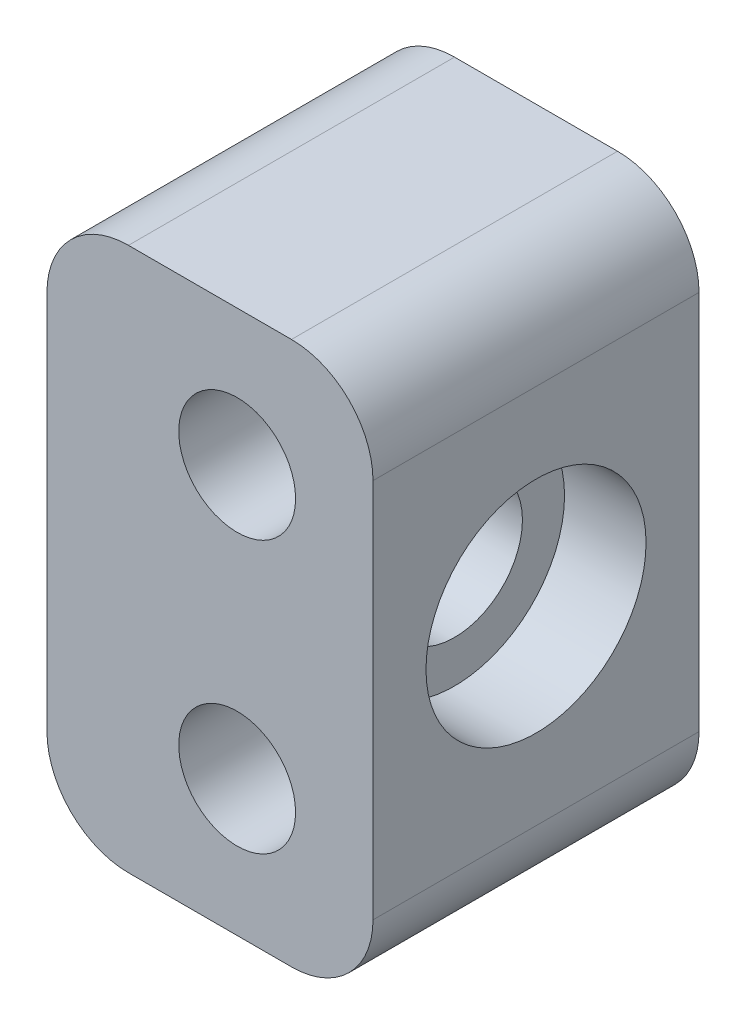
ISO-10303-21;
HEADER;
FILE_DESCRIPTION(('STEP AP214'),'2;1');
FILE_NAME('part.step','',(''),(''),'','','');
FILE_SCHEMA(('AUTOMOTIVE_DESIGN { 1 0 10303 214 1 1 1 1 }'));
ENDSEC;
DATA;
#1=APPLICATION_CONTEXT('core data for automotive mechanical design processes');
#2=APPLICATION_PROTOCOL_DEFINITION('international standard','automotive_design',2000,#1);
#3=PRODUCT_CONTEXT('',#1,'mechanical');
#4=PRODUCT('Part','Part','',(#3));
#5=PRODUCT_RELATED_PRODUCT_CATEGORY('part','',(#4));
#6=PRODUCT_DEFINITION_FORMATION('','',#4);
#7=PRODUCT_DEFINITION_CONTEXT('part definition',#1,'design');
#8=PRODUCT_DEFINITION('design','',#6,#7);
#9=PRODUCT_DEFINITION_SHAPE('','',#8);
#10=(LENGTH_UNIT() NAMED_UNIT(*) SI_UNIT(.MILLI.,.METRE.));
#11=(NAMED_UNIT(*) PLANE_ANGLE_UNIT() SI_UNIT($,.RADIAN.));
#12=(NAMED_UNIT(*) SI_UNIT($,.STERADIAN.) SOLID_ANGLE_UNIT());
#13=UNCERTAINTY_MEASURE_WITH_UNIT(LENGTH_MEASURE(1.E-05),#10,'distance_accuracy_value','');
#14=(GEOMETRIC_REPRESENTATION_CONTEXT(3) GLOBAL_UNCERTAINTY_ASSIGNED_CONTEXT((#13)) GLOBAL_UNIT_ASSIGNED_CONTEXT((#10,
#11,#12)) REPRESENTATION_CONTEXT('',''));
#15=CARTESIAN_POINT('',(0.,0.,0.));
#16=DIRECTION('',(0.,0.,1.));
#17=DIRECTION('',(1.,0.,0.));
#18=AXIS2_PLACEMENT_3D('',#15,#16,#17);
#19=CARTESIAN_POINT('',(5.,0.,6.));
#20=DIRECTION('',(-1.,0.,0.));
#21=DIRECTION('',(0.,0.,1.));
#22=AXIS2_PLACEMENT_3D('',#19,#20,#21);
#23=CYLINDRICAL_SURFACE('',#22,2.5);
#24=CARTESIAN_POINT('',(-2.,0.,6.));
#25=DIRECTION('',(1.,0.,0.));
#26=DIRECTION('',(0.,0.,-1.));
#27=AXIS2_PLACEMENT_3D('',#24,#25,#26);
#28=CIRCLE('',#27,2.5);
#29=CARTESIAN_POINT('',(-2.,0.,3.5));
#30=VERTEX_POINT('',#29);
#31=EDGE_CURVE('E272',#30,#30,#28,.T.);
#32=ORIENTED_EDGE('',*,*,#31,.F.);
#33=EDGE_LOOP('',(#32));
#34=FACE_BOUND('',#33,.T.);
#35=CARTESIAN_POINT('',(2.,0.,6.));
#36=DIRECTION('',(1.,0.,0.));
#37=DIRECTION('',(0.,0.,-1.));
#38=AXIS2_PLACEMENT_3D('',#35,#36,#37);
#39=CIRCLE('',#38,2.5);
#40=CARTESIAN_POINT('',(2.,0.,3.5));
#41=VERTEX_POINT('',#40);
#42=EDGE_CURVE('E45',#41,#41,#39,.F.);
#43=ORIENTED_EDGE('',*,*,#42,.F.);
#44=EDGE_LOOP('',(#43));
#45=FACE_BOUND('',#44,.T.);
#46=ADVANCED_FACE('F41',(#34,#45),#23,.F.);
#47=CARTESIAN_POINT('',(-4.,-7.,12.));
#48=DIRECTION('',(0.,0.,1.));
#49=DIRECTION('',(1.,0.,0.));
#50=AXIS2_PLACEMENT_3D('',#47,#48,#49);
#51=PLANE('',#50);
#52=CARTESIAN_POINT('',(0.,5.,12.));
#53=DIRECTION('',(0.,0.,1.));
#54=DIRECTION('',(1.,0.,0.));
#55=AXIS2_PLACEMENT_3D('',#52,#53,#54);
#56=CIRCLE('',#55,2.15);
#57=CARTESIAN_POINT('',(2.15,5.,12.));
#58=VERTEX_POINT('',#57);
#59=EDGE_CURVE('E162',#58,#58,#56,.T.);
#60=ORIENTED_EDGE('',*,*,#59,.F.);
#61=EDGE_LOOP('',(#60));
#62=FACE_BOUND('',#61,.T.);
#63=CARTESIAN_POINT('',(-4.,-7.,12.));
#64=DIRECTION('',(0.,0.,1.));
#65=DIRECTION('',(1.,0.,0.));
#66=AXIS2_PLACEMENT_3D('',#63,#64,#65);
#67=CIRCLE('',#66,3.);
#68=CARTESIAN_POINT('',(-7.,-7.,12.));
#69=VERTEX_POINT('',#68);
#70=CARTESIAN_POINT('',(-4.,-10.,12.));
#71=VERTEX_POINT('',#70);
#72=EDGE_CURVE('E181',#69,#71,#67,.T.);
#73=ORIENTED_EDGE('',*,*,#72,.T.);
#74=DIRECTION('',(1.,0.,0.));
#75=VECTOR('',#74,1.);
#76=CARTESIAN_POINT('',(-4.,-10.,12.));
#77=LINE('',#76,#75);
#78=CARTESIAN_POINT('',(2.,-10.,12.));
#79=VERTEX_POINT('',#78);
#80=EDGE_CURVE('E108',#71,#79,#77,.T.);
#81=ORIENTED_EDGE('',*,*,#80,.T.);
#82=CARTESIAN_POINT('',(2.,-7.,12.));
#83=DIRECTION('',(0.,0.,1.));
#84=DIRECTION('',(1.,0.,0.));
#85=AXIS2_PLACEMENT_3D('',#82,#83,#84);
#86=CIRCLE('',#85,3.);
#87=CARTESIAN_POINT('',(5.,-7.,12.));
#88=VERTEX_POINT('',#87);
#89=EDGE_CURVE('E203',#79,#88,#86,.T.);
#90=ORIENTED_EDGE('',*,*,#89,.T.);
#91=DIRECTION('',(0.,1.,0.));
#92=VECTOR('',#91,1.);
#93=CARTESIAN_POINT('',(5.,-7.,12.));
#94=LINE('',#93,#92);
#95=CARTESIAN_POINT('',(5.,7.,12.));
#96=VERTEX_POINT('',#95);
#97=EDGE_CURVE('E217',#88,#96,#94,.T.);
#98=ORIENTED_EDGE('',*,*,#97,.T.);
#99=CARTESIAN_POINT('',(2.,7.,12.));
#100=DIRECTION('',(0.,0.,1.));
#101=DIRECTION('',(1.,0.,0.));
#102=AXIS2_PLACEMENT_3D('',#99,#100,#101);
#103=CIRCLE('',#102,3.);
#104=CARTESIAN_POINT('',(2.,10.,12.));
#105=VERTEX_POINT('',#104);
#106=EDGE_CURVE('E132',#96,#105,#103,.T.);
#107=ORIENTED_EDGE('',*,*,#106,.T.);
#108=DIRECTION('',(-1.,0.,0.));
#109=VECTOR('',#108,1.);
#110=CARTESIAN_POINT('',(-4.,10.,12.));
#111=LINE('',#110,#109);
#112=CARTESIAN_POINT('',(-4.,10.,12.));
#113=VERTEX_POINT('',#112);
#114=EDGE_CURVE('E124',#105,#113,#111,.T.);
#115=ORIENTED_EDGE('',*,*,#114,.T.);
#116=CARTESIAN_POINT('',(-4.,7.,12.));
#117=DIRECTION('',(0.,0.,1.));
#118=DIRECTION('',(1.,0.,0.));
#119=AXIS2_PLACEMENT_3D('',#116,#117,#118);
#120=CIRCLE('',#119,3.);
#121=CARTESIAN_POINT('',(-7.,7.,12.));
#122=VERTEX_POINT('',#121);
#123=EDGE_CURVE('E129',#113,#122,#120,.T.);
#124=ORIENTED_EDGE('',*,*,#123,.T.);
#125=DIRECTION('',(0.,-1.,0.));
#126=VECTOR('',#125,1.);
#127=CARTESIAN_POINT('',(-7.,-7.,12.));
#128=LINE('',#127,#126);
#129=EDGE_CURVE('E67',#122,#69,#128,.T.);
#130=ORIENTED_EDGE('',*,*,#129,.T.);
#131=EDGE_LOOP('',(#73,#81,#90,#98,#107,#115,#124,#130));
#132=FACE_BOUND('',#131,.T.);
#133=CARTESIAN_POINT('',(0.,-5.,12.));
#134=DIRECTION('',(0.,0.,1.));
#135=DIRECTION('',(1.,0.,0.));
#136=AXIS2_PLACEMENT_3D('',#133,#134,#135);
#137=CIRCLE('',#136,2.15);
#138=CARTESIAN_POINT('',(2.15,-5.,12.));
#139=VERTEX_POINT('',#138);
#140=EDGE_CURVE('E231',#139,#139,#137,.T.);
#141=ORIENTED_EDGE('',*,*,#140,.F.);
#142=EDGE_LOOP('',(#141));
#143=FACE_BOUND('',#142,.T.);
#144=ADVANCED_FACE('F126',(#62,#132,#143),#51,.T.);
#145=CARTESIAN_POINT('',(-4.,-7.,0.));
#146=DIRECTION('',(0.,0.,1.));
#147=DIRECTION('',(1.,0.,0.));
#148=AXIS2_PLACEMENT_3D('',#145,#146,#147);
#149=PLANE('',#148);
#150=CARTESIAN_POINT('',(-4.,-7.,0.));
#151=DIRECTION('',(0.,0.,1.));
#152=DIRECTION('',(1.,0.,0.));
#153=AXIS2_PLACEMENT_3D('',#150,#151,#152);
#154=CIRCLE('',#153,3.);
#155=CARTESIAN_POINT('',(-7.,-7.,0.));
#156=VERTEX_POINT('',#155);
#157=CARTESIAN_POINT('',(-4.,-10.,0.));
#158=VERTEX_POINT('',#157);
#159=EDGE_CURVE('E157',#156,#158,#154,.T.);
#160=ORIENTED_EDGE('',*,*,#159,.F.);
#161=DIRECTION('',(0.,-1.,0.));
#162=VECTOR('',#161,1.);
#163=CARTESIAN_POINT('',(-7.,-7.,0.));
#164=LINE('',#163,#162);
#165=CARTESIAN_POINT('',(-7.,7.,0.));
#166=VERTEX_POINT('',#165);
#167=EDGE_CURVE('E100',#166,#156,#164,.T.);
#168=ORIENTED_EDGE('',*,*,#167,.F.);
#169=CARTESIAN_POINT('',(-4.,7.,0.));
#170=DIRECTION('',(0.,0.,1.));
#171=DIRECTION('',(1.,0.,0.));
#172=AXIS2_PLACEMENT_3D('',#169,#170,#171);
#173=CIRCLE('',#172,3.);
#174=CARTESIAN_POINT('',(-4.,10.,0.));
#175=VERTEX_POINT('',#174);
#176=EDGE_CURVE('E176',#175,#166,#173,.T.);
#177=ORIENTED_EDGE('',*,*,#176,.F.);
#178=DIRECTION('',(-1.,0.,0.));
#179=VECTOR('',#178,1.);
#180=CARTESIAN_POINT('',(-4.,10.,0.));
#181=LINE('',#180,#179);
#182=CARTESIAN_POINT('',(2.,10.,0.));
#183=VERTEX_POINT('',#182);
#184=EDGE_CURVE('E142',#183,#175,#181,.T.);
#185=ORIENTED_EDGE('',*,*,#184,.F.);
#186=CARTESIAN_POINT('',(2.,7.,0.));
#187=DIRECTION('',(0.,0.,1.));
#188=DIRECTION('',(1.,0.,0.));
#189=AXIS2_PLACEMENT_3D('',#186,#187,#188);
#190=CIRCLE('',#189,3.);
#191=CARTESIAN_POINT('',(5.,7.,0.));
#192=VERTEX_POINT('',#191);
#193=EDGE_CURVE('E171',#192,#183,#190,.T.);
#194=ORIENTED_EDGE('',*,*,#193,.F.);
#195=DIRECTION('',(0.,1.,0.));
#196=VECTOR('',#195,1.);
#197=CARTESIAN_POINT('',(5.,-7.,0.));
#198=LINE('',#197,#196);
#199=CARTESIAN_POINT('',(5.,-7.,0.));
#200=VERTEX_POINT('',#199);
#201=EDGE_CURVE('E168',#200,#192,#198,.T.);
#202=ORIENTED_EDGE('',*,*,#201,.F.);
#203=CARTESIAN_POINT('',(2.,-7.,0.));
#204=DIRECTION('',(0.,0.,1.));
#205=DIRECTION('',(1.,0.,0.));
#206=AXIS2_PLACEMENT_3D('',#203,#204,#205);
#207=CIRCLE('',#206,3.);
#208=CARTESIAN_POINT('',(2.,-10.,0.));
#209=VERTEX_POINT('',#208);
#210=EDGE_CURVE('E165',#209,#200,#207,.T.);
#211=ORIENTED_EDGE('',*,*,#210,.F.);
#212=DIRECTION('',(1.,0.,0.));
#213=VECTOR('',#212,1.);
#214=CARTESIAN_POINT('',(-4.,-10.,0.));
#215=LINE('',#214,#213);
#216=EDGE_CURVE('E161',#158,#209,#215,.T.);
#217=ORIENTED_EDGE('',*,*,#216,.F.);
#218=EDGE_LOOP('',(#160,#168,#177,#185,#194,#202,#211,#217));
#219=FACE_BOUND('',#218,.T.);
#220=CARTESIAN_POINT('',(0.,5.,0.));
#221=DIRECTION('',(0.,0.,1.));
#222=DIRECTION('',(1.,0.,0.));
#223=AXIS2_PLACEMENT_3D('',#220,#221,#222);
#224=CIRCLE('',#223,2.15);
#225=CARTESIAN_POINT('',(2.15,5.,0.));
#226=VERTEX_POINT('',#225);
#227=EDGE_CURVE('E227',#226,#226,#224,.T.);
#228=ORIENTED_EDGE('',*,*,#227,.T.);
#229=EDGE_LOOP('',(#228));
#230=FACE_BOUND('',#229,.T.);
#231=CARTESIAN_POINT('',(0.,-5.,0.));
#232=DIRECTION('',(0.,0.,1.));
#233=DIRECTION('',(1.,0.,0.));
#234=AXIS2_PLACEMENT_3D('',#231,#232,#233);
#235=CIRCLE('',#234,2.15);
#236=CARTESIAN_POINT('',(2.15,-5.,0.));
#237=VERTEX_POINT('',#236);
#238=EDGE_CURVE('E235',#237,#237,#235,.T.);
#239=ORIENTED_EDGE('',*,*,#238,.T.);
#240=EDGE_LOOP('',(#239));
#241=FACE_BOUND('',#240,.T.);
#242=ADVANCED_FACE('F207',(#219,#230,#241),#149,.F.);
#243=CARTESIAN_POINT('',(-4.,-7.,12.));
#244=DIRECTION('',(0.,0.,-1.));
#245=DIRECTION('',(-1.,0.,0.));
#246=AXIS2_PLACEMENT_3D('',#243,#244,#245);
#247=CYLINDRICAL_SURFACE('',#246,3.);
#248=ORIENTED_EDGE('',*,*,#159,.T.);
#249=DIRECTION('',(0.,0.,-1.));
#250=VECTOR('',#249,1.);
#251=CARTESIAN_POINT('',(-4.,-10.,12.));
#252=LINE('',#251,#250);
#253=EDGE_CURVE('E11',#71,#158,#252,.T.);
#254=ORIENTED_EDGE('',*,*,#253,.F.);
#255=ORIENTED_EDGE('',*,*,#72,.F.);
#256=DIRECTION('',(0.,0.,-1.));
#257=VECTOR('',#256,1.);
#258=CARTESIAN_POINT('',(-7.,-7.,12.));
#259=LINE('',#258,#257);
#260=EDGE_CURVE('E153',#69,#156,#259,.T.);
#261=ORIENTED_EDGE('',*,*,#260,.T.);
#262=EDGE_LOOP('',(#248,#254,#255,#261));
#263=FACE_BOUND('',#262,.T.);
#264=ADVANCED_FACE('F43',(#263),#247,.T.);
#265=CARTESIAN_POINT('',(-4.,-10.,12.));
#266=DIRECTION('',(0.,1.,0.));
#267=DIRECTION('',(-1.,0.,0.));
#268=AXIS2_PLACEMENT_3D('',#265,#266,#267);
#269=PLANE('',#268);
#270=ORIENTED_EDGE('',*,*,#216,.T.);
#271=DIRECTION('',(0.,0.,-1.));
#272=VECTOR('',#271,1.);
#273=CARTESIAN_POINT('',(2.,-10.,12.));
#274=LINE('',#273,#272);
#275=EDGE_CURVE('E51',#79,#209,#274,.T.);
#276=ORIENTED_EDGE('',*,*,#275,.F.);
#277=ORIENTED_EDGE('',*,*,#80,.F.);
#278=ORIENTED_EDGE('',*,*,#253,.T.);
#279=EDGE_LOOP('',(#270,#276,#277,#278));
#280=FACE_BOUND('',#279,.T.);
#281=ADVANCED_FACE('F361',(#280),#269,.F.);
#282=CARTESIAN_POINT('',(2.,-7.,12.));
#283=DIRECTION('',(0.,0.,-1.));
#284=DIRECTION('',(-1.,0.,0.));
#285=AXIS2_PLACEMENT_3D('',#282,#283,#284);
#286=CYLINDRICAL_SURFACE('',#285,3.);
#287=ORIENTED_EDGE('',*,*,#210,.T.);
#288=DIRECTION('',(0.,0.,-1.));
#289=VECTOR('',#288,1.);
#290=CARTESIAN_POINT('',(5.,-7.,12.));
#291=LINE('',#290,#289);
#292=EDGE_CURVE('E192',#88,#200,#291,.T.);
#293=ORIENTED_EDGE('',*,*,#292,.F.);
#294=ORIENTED_EDGE('',*,*,#89,.F.);
#295=ORIENTED_EDGE('',*,*,#275,.T.);
#296=EDGE_LOOP('',(#287,#293,#294,#295));
#297=FACE_BOUND('',#296,.T.);
#298=ADVANCED_FACE('F201',(#297),#286,.T.);
#299=CARTESIAN_POINT('',(5.,-7.,12.));
#300=DIRECTION('',(-1.,0.,0.));
#301=DIRECTION('',(0.,0.,1.));
#302=AXIS2_PLACEMENT_3D('',#299,#300,#301);
#303=PLANE('',#302);
#304=CARTESIAN_POINT('',(5.,0.,6.));
#305=DIRECTION('',(1.,0.,0.));
#306=DIRECTION('',(0.,0.,-1.));
#307=AXIS2_PLACEMENT_3D('',#304,#305,#306);
#308=CIRCLE('',#307,4.05);
#309=CARTESIAN_POINT('',(5.,0.,1.95));
#310=VERTEX_POINT('',#309);
#311=EDGE_CURVE('E290',#310,#310,#308,.T.);
#312=ORIENTED_EDGE('',*,*,#311,.F.);
#313=EDGE_LOOP('',(#312));
#314=FACE_BOUND('',#313,.T.);
#315=ORIENTED_EDGE('',*,*,#201,.T.);
#316=DIRECTION('',(0.,0.,-1.));
#317=VECTOR('',#316,1.);
#318=CARTESIAN_POINT('',(5.,7.,12.));
#319=LINE('',#318,#317);
#320=EDGE_CURVE('E188',#96,#192,#319,.T.);
#321=ORIENTED_EDGE('',*,*,#320,.F.);
#322=ORIENTED_EDGE('',*,*,#97,.F.);
#323=ORIENTED_EDGE('',*,*,#292,.T.);
#324=EDGE_LOOP('',(#315,#321,#322,#323));
#325=FACE_BOUND('',#324,.T.);
#326=ADVANCED_FACE('F212',(#314,#325),#303,.F.);
#327=CARTESIAN_POINT('',(2.,7.,12.));
#328=DIRECTION('',(0.,0.,-1.));
#329=DIRECTION('',(-1.,0.,0.));
#330=AXIS2_PLACEMENT_3D('',#327,#328,#329);
#331=CYLINDRICAL_SURFACE('',#330,3.);
#332=ORIENTED_EDGE('',*,*,#193,.T.);
#333=DIRECTION('',(0.,0.,-1.));
#334=VECTOR('',#333,1.);
#335=CARTESIAN_POINT('',(2.,10.,12.));
#336=LINE('',#335,#334);
#337=EDGE_CURVE('E146',#105,#183,#336,.T.);
#338=ORIENTED_EDGE('',*,*,#337,.F.);
#339=ORIENTED_EDGE('',*,*,#106,.F.);
#340=ORIENTED_EDGE('',*,*,#320,.T.);
#341=EDGE_LOOP('',(#332,#338,#339,#340));
#342=FACE_BOUND('',#341,.T.);
#343=ADVANCED_FACE('F215',(#342),#331,.T.);
#344=CARTESIAN_POINT('',(-4.,10.,12.));
#345=DIRECTION('',(0.,-1.,0.));
#346=DIRECTION('',(1.,0.,0.));
#347=AXIS2_PLACEMENT_3D('',#344,#345,#346);
#348=PLANE('',#347);
#349=ORIENTED_EDGE('',*,*,#184,.T.);
#350=DIRECTION('',(0.,0.,-1.));
#351=VECTOR('',#350,1.);
#352=CARTESIAN_POINT('',(-4.,10.,12.));
#353=LINE('',#352,#351);
#354=EDGE_CURVE('E139',#113,#175,#353,.T.);
#355=ORIENTED_EDGE('',*,*,#354,.F.);
#356=ORIENTED_EDGE('',*,*,#114,.F.);
#357=ORIENTED_EDGE('',*,*,#337,.T.);
#358=EDGE_LOOP('',(#349,#355,#356,#357));
#359=FACE_BOUND('',#358,.T.);
#360=ADVANCED_FACE('F140',(#359),#348,.F.);
#361=CARTESIAN_POINT('',(-4.,7.,12.));
#362=DIRECTION('',(0.,0.,-1.));
#363=DIRECTION('',(-1.,0.,0.));
#364=AXIS2_PLACEMENT_3D('',#361,#362,#363);
#365=CYLINDRICAL_SURFACE('',#364,3.);
#366=ORIENTED_EDGE('',*,*,#176,.T.);
#367=DIRECTION('',(0.,0.,-1.));
#368=VECTOR('',#367,1.);
#369=CARTESIAN_POINT('',(-7.,7.,12.));
#370=LINE('',#369,#368);
#371=EDGE_CURVE('E147',#122,#166,#370,.T.);
#372=ORIENTED_EDGE('',*,*,#371,.F.);
#373=ORIENTED_EDGE('',*,*,#123,.F.);
#374=ORIENTED_EDGE('',*,*,#354,.T.);
#375=EDGE_LOOP('',(#366,#372,#373,#374));
#376=FACE_BOUND('',#375,.T.);
#377=ADVANCED_FACE('F149',(#376),#365,.T.);
#378=CARTESIAN_POINT('',(-7.,-7.,12.));
#379=DIRECTION('',(1.,0.,0.));
#380=DIRECTION('',(0.,1.,0.));
#381=AXIS2_PLACEMENT_3D('',#378,#379,#380);
#382=PLANE('',#381);
#383=DIRECTION('',(0.,0.,-1.));
#384=VECTOR('',#383,1.);
#385=CARTESIAN_POINT('',(-7.,3.75,2.25));
#386=LINE('',#385,#384);
#387=CARTESIAN_POINT('',(-7.,3.75,9.75));
#388=VERTEX_POINT('',#387);
#389=CARTESIAN_POINT('',(-7.,3.75,2.25));
#390=VERTEX_POINT('',#389);
#391=EDGE_CURVE('E266',#388,#390,#386,.T.);
#392=ORIENTED_EDGE('',*,*,#391,.F.);
#393=DIRECTION('',(0.,1.,0.));
#394=VECTOR('',#393,1.);
#395=CARTESIAN_POINT('',(-7.,-3.75,9.75));
#396=LINE('',#395,#394);
#397=CARTESIAN_POINT('',(-7.,-3.75,9.75));
#398=VERTEX_POINT('',#397);
#399=EDGE_CURVE('E58',#398,#388,#396,.T.);
#400=ORIENTED_EDGE('',*,*,#399,.F.);
#401=DIRECTION('',(0.,0.,1.));
#402=VECTOR('',#401,1.);
#403=CARTESIAN_POINT('',(-7.,-3.75,2.25));
#404=LINE('',#403,#402);
#405=CARTESIAN_POINT('',(-7.,-3.75,2.25));
#406=VERTEX_POINT('',#405);
#407=EDGE_CURVE('E257',#406,#398,#404,.T.);
#408=ORIENTED_EDGE('',*,*,#407,.F.);
#409=DIRECTION('',(0.,-1.,0.));
#410=VECTOR('',#409,1.);
#411=CARTESIAN_POINT('',(-7.,-3.75,2.25));
#412=LINE('',#411,#410);
#413=EDGE_CURVE('E262',#390,#406,#412,.T.);
#414=ORIENTED_EDGE('',*,*,#413,.F.);
#415=EDGE_LOOP('',(#392,#400,#408,#414));
#416=FACE_BOUND('',#415,.T.);
#417=ORIENTED_EDGE('',*,*,#167,.T.);
#418=ORIENTED_EDGE('',*,*,#260,.F.);
#419=ORIENTED_EDGE('',*,*,#129,.F.);
#420=ORIENTED_EDGE('',*,*,#371,.T.);
#421=EDGE_LOOP('',(#417,#418,#419,#420));
#422=FACE_BOUND('',#421,.T.);
#423=ADVANCED_FACE('F343',(#416,#422),#382,.F.);
#424=CARTESIAN_POINT('',(0.,5.,12.));
#425=DIRECTION('',(0.,0.,-1.));
#426=DIRECTION('',(-1.,0.,0.));
#427=AXIS2_PLACEMENT_3D('',#424,#425,#426);
#428=CYLINDRICAL_SURFACE('',#427,2.15);
#429=ORIENTED_EDGE('',*,*,#59,.T.);
#430=EDGE_LOOP('',(#429));
#431=FACE_BOUND('',#430,.T.);
#432=ORIENTED_EDGE('',*,*,#227,.F.);
#433=EDGE_LOOP('',(#432));
#434=FACE_BOUND('',#433,.T.);
#435=ADVANCED_FACE('F340',(#431,#434),#428,.F.);
#436=CARTESIAN_POINT('',(0.,-5.,12.));
#437=DIRECTION('',(0.,0.,-1.));
#438=DIRECTION('',(-1.,0.,0.));
#439=AXIS2_PLACEMENT_3D('',#436,#437,#438);
#440=CYLINDRICAL_SURFACE('',#439,2.15);
#441=ORIENTED_EDGE('',*,*,#140,.T.);
#442=EDGE_LOOP('',(#441));
#443=FACE_BOUND('',#442,.T.);
#444=ORIENTED_EDGE('',*,*,#238,.F.);
#445=EDGE_LOOP('',(#444));
#446=FACE_BOUND('',#445,.T.);
#447=ADVANCED_FACE('F337',(#443,#446),#440,.F.);
#448=CARTESIAN_POINT('',(-2.,-3.75,9.75));
#449=DIRECTION('',(0.,0.,1.));
#450=DIRECTION('',(1.,0.,0.));
#451=AXIS2_PLACEMENT_3D('',#448,#449,#450);
#452=PLANE('',#451);
#453=ORIENTED_EDGE('',*,*,#399,.T.);
#454=DIRECTION('',(-1.,0.,0.));
#455=VECTOR('',#454,1.);
#456=CARTESIAN_POINT('',(-2.,3.75,9.75));
#457=LINE('',#456,#455);
#458=CARTESIAN_POINT('',(-2.,3.75,9.75));
#459=VERTEX_POINT('',#458);
#460=EDGE_CURVE('E243',#459,#388,#457,.T.);
#461=ORIENTED_EDGE('',*,*,#460,.F.);
#462=DIRECTION('',(0.,1.,0.));
#463=VECTOR('',#462,1.);
#464=CARTESIAN_POINT('',(-2.,-3.75,9.75));
#465=LINE('',#464,#463);
#466=CARTESIAN_POINT('',(-2.,-3.75,9.75));
#467=VERTEX_POINT('',#466);
#468=EDGE_CURVE('E261',#467,#459,#465,.T.);
#469=ORIENTED_EDGE('',*,*,#468,.F.);
#470=DIRECTION('',(-1.,0.,0.));
#471=VECTOR('',#470,1.);
#472=CARTESIAN_POINT('',(-2.,-3.75,9.75));
#473=LINE('',#472,#471);
#474=EDGE_CURVE('E239',#467,#398,#473,.T.);
#475=ORIENTED_EDGE('',*,*,#474,.T.);
#476=EDGE_LOOP('',(#453,#461,#469,#475));
#477=FACE_BOUND('',#476,.T.);
#478=ADVANCED_FACE('F327',(#477),#452,.F.);
#479=CARTESIAN_POINT('',(-2.,-3.75,2.25));
#480=DIRECTION('',(0.,-1.,0.));
#481=DIRECTION('',(0.,0.,-1.));
#482=AXIS2_PLACEMENT_3D('',#479,#480,#481);
#483=PLANE('',#482);
#484=ORIENTED_EDGE('',*,*,#407,.T.);
#485=ORIENTED_EDGE('',*,*,#474,.F.);
#486=DIRECTION('',(0.,0.,1.));
#487=VECTOR('',#486,1.);
#488=CARTESIAN_POINT('',(-2.,-3.75,2.25));
#489=LINE('',#488,#487);
#490=CARTESIAN_POINT('',(-2.,-3.75,2.25));
#491=VERTEX_POINT('',#490);
#492=EDGE_CURVE('E247',#491,#467,#489,.T.);
#493=ORIENTED_EDGE('',*,*,#492,.F.);
#494=DIRECTION('',(-1.,0.,0.));
#495=VECTOR('',#494,1.);
#496=CARTESIAN_POINT('',(-2.,-3.75,2.25));
#497=LINE('',#496,#495);
#498=EDGE_CURVE('E251',#491,#406,#497,.T.);
#499=ORIENTED_EDGE('',*,*,#498,.T.);
#500=EDGE_LOOP('',(#484,#485,#493,#499));
#501=FACE_BOUND('',#500,.T.);
#502=ADVANCED_FACE('F323',(#501),#483,.F.);
#503=CARTESIAN_POINT('',(-2.,-3.75,2.25));
#504=DIRECTION('',(0.,0.,-1.));
#505=DIRECTION('',(-1.,0.,0.));
#506=AXIS2_PLACEMENT_3D('',#503,#504,#505);
#507=PLANE('',#506);
#508=ORIENTED_EDGE('',*,*,#413,.T.);
#509=ORIENTED_EDGE('',*,*,#498,.F.);
#510=DIRECTION('',(0.,-1.,0.));
#511=VECTOR('',#510,1.);
#512=CARTESIAN_POINT('',(-2.,-3.75,2.25));
#513=LINE('',#512,#511);
#514=CARTESIAN_POINT('',(-2.,3.75,2.25));
#515=VERTEX_POINT('',#514);
#516=EDGE_CURVE('E276',#515,#491,#513,.T.);
#517=ORIENTED_EDGE('',*,*,#516,.F.);
#518=DIRECTION('',(-1.,0.,0.));
#519=VECTOR('',#518,1.);
#520=CARTESIAN_POINT('',(-2.,3.75,2.25));
#521=LINE('',#520,#519);
#522=EDGE_CURVE('E246',#515,#390,#521,.T.);
#523=ORIENTED_EDGE('',*,*,#522,.T.);
#524=EDGE_LOOP('',(#508,#509,#517,#523));
#525=FACE_BOUND('',#524,.T.);
#526=ADVANCED_FACE('F326',(#525),#507,.F.);
#527=CARTESIAN_POINT('',(-2.,3.75,2.25));
#528=DIRECTION('',(0.,1.,0.));
#529=DIRECTION('',(0.,0.,1.));
#530=AXIS2_PLACEMENT_3D('',#527,#528,#529);
#531=PLANE('',#530);
#532=ORIENTED_EDGE('',*,*,#391,.T.);
#533=ORIENTED_EDGE('',*,*,#522,.F.);
#534=DIRECTION('',(0.,0.,-1.));
#535=VECTOR('',#534,1.);
#536=CARTESIAN_POINT('',(-2.,3.75,2.25));
#537=LINE('',#536,#535);
#538=EDGE_CURVE('E280',#459,#515,#537,.T.);
#539=ORIENTED_EDGE('',*,*,#538,.F.);
#540=ORIENTED_EDGE('',*,*,#460,.T.);
#541=EDGE_LOOP('',(#532,#533,#539,#540));
#542=FACE_BOUND('',#541,.T.);
#543=ADVANCED_FACE('F321',(#542),#531,.F.);
#544=CARTESIAN_POINT('',(-2.,0.,0.));
#545=DIRECTION('',(1.,0.,0.));
#546=DIRECTION('',(0.,0.,-1.));
#547=AXIS2_PLACEMENT_3D('',#544,#545,#546);
#548=PLANE('',#547);
#549=ORIENTED_EDGE('',*,*,#31,.T.);
#550=EDGE_LOOP('',(#549));
#551=FACE_BOUND('',#550,.T.);
#552=ORIENTED_EDGE('',*,*,#468,.T.);
#553=ORIENTED_EDGE('',*,*,#538,.T.);
#554=ORIENTED_EDGE('',*,*,#516,.T.);
#555=ORIENTED_EDGE('',*,*,#492,.T.);
#556=EDGE_LOOP('',(#552,#553,#554,#555));
#557=FACE_BOUND('',#556,.T.);
#558=ADVANCED_FACE('F318',(#551,#557),#548,.F.);
#559=CARTESIAN_POINT('',(2.,0.,6.));
#560=DIRECTION('',(1.,0.,0.));
#561=DIRECTION('',(0.,0.,-1.));
#562=AXIS2_PLACEMENT_3D('',#559,#560,#561);
#563=PLANE('',#562);
#564=CARTESIAN_POINT('',(2.,0.,6.));
#565=DIRECTION('',(1.,0.,0.));
#566=DIRECTION('',(0.,0.,-1.));
#567=AXIS2_PLACEMENT_3D('',#564,#565,#566);
#568=CIRCLE('',#567,4.05);
#569=CARTESIAN_POINT('',(2.,0.,1.95));
#570=VERTEX_POINT('',#569);
#571=EDGE_CURVE('E294',#570,#570,#568,.T.);
#572=ORIENTED_EDGE('',*,*,#571,.T.);
#573=EDGE_LOOP('',(#572));
#574=FACE_BOUND('',#573,.T.);
#575=ORIENTED_EDGE('',*,*,#42,.T.);
#576=EDGE_LOOP('',(#575));
#577=FACE_BOUND('',#576,.T.);
#578=ADVANCED_FACE('F303',(#574,#577),#563,.T.);
#579=CARTESIAN_POINT('',(2.,0.,6.));
#580=DIRECTION('',(1.,0.,0.));
#581=DIRECTION('',(0.,0.,-1.));
#582=AXIS2_PLACEMENT_3D('',#579,#580,#581);
#583=CYLINDRICAL_SURFACE('',#582,4.05);
#584=ORIENTED_EDGE('',*,*,#571,.F.);
#585=EDGE_LOOP('',(#584));
#586=FACE_BOUND('',#585,.T.);
#587=ORIENTED_EDGE('',*,*,#311,.T.);
#588=EDGE_LOOP('',(#587));
#589=FACE_BOUND('',#588,.T.);
#590=ADVANCED_FACE('F316',(#586,#589),#583,.F.);
#591=CLOSED_SHELL('',(#46,#144,#242,#264,#281,#298,#326,#343,#360,#377,#423,#435,#447,#478,#502,
#526,#543,#558,#578,#590));
#592=MANIFOLD_SOLID_BREP('B2',#591);
#593=ADVANCED_BREP_SHAPE_REPRESENTATION('',(#18,#592),#14);
#594=SHAPE_DEFINITION_REPRESENTATION(#9,#593);
ENDSEC;
END-ISO-10303-21;
